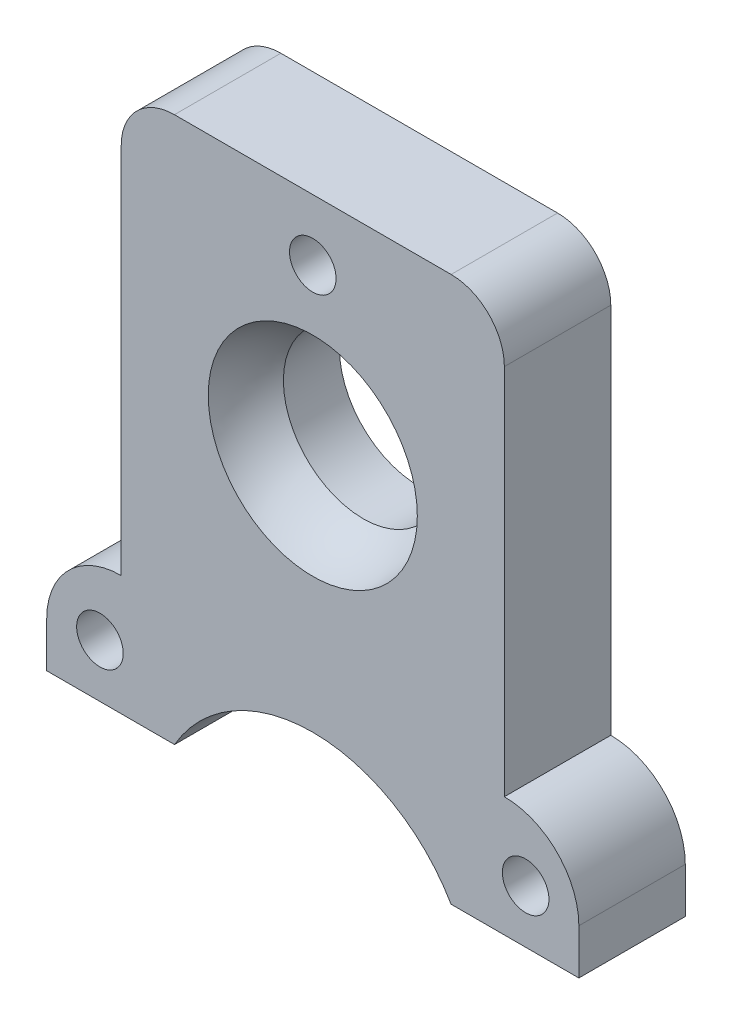
ISO-10303-21;
HEADER;
FILE_DESCRIPTION(('STEP AP214'),'2;1');
FILE_NAME('part.step','',(''),(''),'','','');
FILE_SCHEMA(('AUTOMOTIVE_DESIGN { 1 0 10303 214 1 1 1 1 }'));
ENDSEC;
DATA;
#1=APPLICATION_CONTEXT('core data for automotive mechanical design processes');
#2=APPLICATION_PROTOCOL_DEFINITION('international standard','automotive_design',2000,#1);
#3=PRODUCT_CONTEXT('',#1,'mechanical');
#4=PRODUCT('Part','Part','',(#3));
#5=PRODUCT_RELATED_PRODUCT_CATEGORY('part','',(#4));
#6=PRODUCT_DEFINITION_FORMATION('','',#4);
#7=PRODUCT_DEFINITION_CONTEXT('part definition',#1,'design');
#8=PRODUCT_DEFINITION('design','',#6,#7);
#9=PRODUCT_DEFINITION_SHAPE('','',#8);
#10=(LENGTH_UNIT() NAMED_UNIT(*) SI_UNIT(.MILLI.,.METRE.));
#11=(NAMED_UNIT(*) PLANE_ANGLE_UNIT() SI_UNIT($,.RADIAN.));
#12=(NAMED_UNIT(*) SI_UNIT($,.STERADIAN.) SOLID_ANGLE_UNIT());
#13=UNCERTAINTY_MEASURE_WITH_UNIT(LENGTH_MEASURE(1.E-05),#10,'distance_accuracy_value','');
#14=(GEOMETRIC_REPRESENTATION_CONTEXT(3) GLOBAL_UNCERTAINTY_ASSIGNED_CONTEXT((#13)) GLOBAL_UNIT_ASSIGNED_CONTEXT((#10,
#11,#12)) REPRESENTATION_CONTEXT('',''));
#15=CARTESIAN_POINT('',(0.,0.,0.));
#16=DIRECTION('',(0.,0.,1.));
#17=DIRECTION('',(1.,0.,0.));
#18=AXIS2_PLACEMENT_3D('',#15,#16,#17);
#19=CARTESIAN_POINT('',(0.,-12.1285,0.));
#20=DIRECTION('',(0.,0.,1.));
#21=DIRECTION('',(1.,0.,0.));
#22=AXIS2_PLACEMENT_3D('',#19,#20,#21);
#23=PLANE('',#22);
#24=CARTESIAN_POINT('',(0.,21.5265,0.));
#25=DIRECTION('',(0.,0.,1.));
#26=DIRECTION('',(1.,0.,0.));
#27=AXIS2_PLACEMENT_3D('',#24,#25,#26);
#28=CIRCLE('',#27,1.3890625);
#29=CARTESIAN_POINT('',(1.3890625,21.5265,0.));
#30=VERTEX_POINT('',#29);
#31=EDGE_CURVE('E644',#30,#30,#28,.T.);
#32=ORIENTED_EDGE('',*,*,#31,.F.);
#33=EDGE_LOOP('',(#32));
#34=FACE_BOUND('',#33,.T.);
#35=CARTESIAN_POINT('',(-12.7,-4.191,0.));
#36=DIRECTION('',(0.,0.,1.));
#37=DIRECTION('',(1.,0.,0.));
#38=AXIS2_PLACEMENT_3D('',#35,#36,#37);
#39=CIRCLE('',#38,1.3890625);
#40=CARTESIAN_POINT('',(-11.3109375,-4.191,0.));
#41=VERTEX_POINT('',#40);
#42=EDGE_CURVE('E640',#41,#41,#39,.T.);
#43=ORIENTED_EDGE('',*,*,#42,.F.);
#44=EDGE_LOOP('',(#43));
#45=FACE_BOUND('',#44,.T.);
#46=CARTESIAN_POINT('',(12.7,-4.191,0.));
#47=DIRECTION('',(0.,0.,1.));
#48=DIRECTION('',(-1.,0.,0.));
#49=AXIS2_PLACEMENT_3D('',#46,#47,#48);
#50=CIRCLE('',#49,1.3890625);
#51=CARTESIAN_POINT('',(11.3109375,-4.191,0.));
#52=VERTEX_POINT('',#51);
#53=EDGE_CURVE('E636',#52,#52,#50,.T.);
#54=ORIENTED_EDGE('',*,*,#53,.F.);
#55=EDGE_LOOP('',(#54));
#56=FACE_BOUND('',#55,.T.);
#57=CARTESIAN_POINT('',(0.,-12.1285,0.));
#58=DIRECTION('',(0.,0.,-1.));
#59=DIRECTION('',(1.,0.,0.));
#60=AXIS2_PLACEMENT_3D('',#57,#58,#59);
#61=CIRCLE('',#60,9.525);
#62=CARTESIAN_POINT('',(-8.24889197104678,-7.36600000000001,0.));
#63=VERTEX_POINT('',#62);
#64=CARTESIAN_POINT('',(8.24889197104678,-7.36600000000001,0.));
#65=VERTEX_POINT('',#64);
#66=EDGE_CURVE('E450',#63,#65,#61,.T.);
#67=ORIENTED_EDGE('',*,*,#66,.T.);
#68=DIRECTION('',(1.,0.,0.));
#69=VECTOR('',#68,1.);
#70=CARTESIAN_POINT('',(8.24889197104678,-7.36600000000001,0.));
#71=LINE('',#70,#69);
#72=CARTESIAN_POINT('',(15.875,-7.36600000000001,0.));
#73=VERTEX_POINT('',#72);
#74=EDGE_CURVE('E459',#65,#73,#71,.T.);
#75=ORIENTED_EDGE('',*,*,#74,.T.);
#76=DIRECTION('',(0.,1.,0.));
#77=VECTOR('',#76,1.);
#78=CARTESIAN_POINT('',(15.875,-7.36600000000001,0.));
#79=LINE('',#78,#77);
#80=CARTESIAN_POINT('',(15.875,-4.66725,0.));
#81=VERTEX_POINT('',#80);
#82=EDGE_CURVE('E464',#73,#81,#79,.T.);
#83=ORIENTED_EDGE('',*,*,#82,.T.);
#84=CARTESIAN_POINT('',(11.43,-4.66725000000001,0.));
#85=DIRECTION('',(0.,0.,1.));
#86=DIRECTION('',(1.,0.,0.));
#87=AXIS2_PLACEMENT_3D('',#84,#85,#86);
#88=CIRCLE('',#87,4.445);
#89=CARTESIAN_POINT('',(11.43,-0.222250000000007,0.));
#90=VERTEX_POINT('',#89);
#91=EDGE_CURVE('E477',#81,#90,#88,.T.);
#92=ORIENTED_EDGE('',*,*,#91,.T.);
#93=DIRECTION('',(0.,1.,0.));
#94=VECTOR('',#93,1.);
#95=CARTESIAN_POINT('',(11.43,-0.222250000000007,0.));
#96=LINE('',#95,#94);
#97=CARTESIAN_POINT('',(11.43,22.00275,0.));
#98=VERTEX_POINT('',#97);
#99=EDGE_CURVE('E480',#90,#98,#96,.T.);
#100=ORIENTED_EDGE('',*,*,#99,.T.);
#101=CARTESIAN_POINT('',(8.255,22.00275,0.));
#102=DIRECTION('',(0.,0.,1.));
#103=DIRECTION('',(1.,0.,0.));
#104=AXIS2_PLACEMENT_3D('',#101,#102,#103);
#105=CIRCLE('',#104,3.175);
#106=CARTESIAN_POINT('',(8.255,25.17775,0.));
#107=VERTEX_POINT('',#106);
#108=EDGE_CURVE('E483',#98,#107,#105,.T.);
#109=ORIENTED_EDGE('',*,*,#108,.T.);
#110=DIRECTION('',(-1.,0.,0.));
#111=VECTOR('',#110,1.);
#112=CARTESIAN_POINT('',(8.255,25.17775,0.));
#113=LINE('',#112,#111);
#114=CARTESIAN_POINT('',(-8.255,25.17775,0.));
#115=VERTEX_POINT('',#114);
#116=EDGE_CURVE('E486',#107,#115,#113,.T.);
#117=ORIENTED_EDGE('',*,*,#116,.T.);
#118=CARTESIAN_POINT('',(-8.255,22.00275,0.));
#119=DIRECTION('',(0.,0.,1.));
#120=DIRECTION('',(-1.,0.,0.));
#121=AXIS2_PLACEMENT_3D('',#118,#119,#120);
#122=CIRCLE('',#121,3.175);
#123=CARTESIAN_POINT('',(-11.43,22.00275,0.));
#124=VERTEX_POINT('',#123);
#125=EDGE_CURVE('E489',#115,#124,#122,.T.);
#126=ORIENTED_EDGE('',*,*,#125,.T.);
#127=DIRECTION('',(0.,-1.,0.));
#128=VECTOR('',#127,1.);
#129=CARTESIAN_POINT('',(-11.43,-0.222250000000007,0.));
#130=LINE('',#129,#128);
#131=CARTESIAN_POINT('',(-11.43,-0.222250000000008,0.));
#132=VERTEX_POINT('',#131);
#133=EDGE_CURVE('E492',#124,#132,#130,.T.);
#134=ORIENTED_EDGE('',*,*,#133,.T.);
#135=CARTESIAN_POINT('',(-11.43,-4.66725000000001,0.));
#136=DIRECTION('',(0.,0.,1.));
#137=DIRECTION('',(-1.,0.,0.));
#138=AXIS2_PLACEMENT_3D('',#135,#136,#137);
#139=CIRCLE('',#138,4.445);
#140=CARTESIAN_POINT('',(-15.875,-4.66725,0.));
#141=VERTEX_POINT('',#140);
#142=EDGE_CURVE('E495',#132,#141,#139,.T.);
#143=ORIENTED_EDGE('',*,*,#142,.T.);
#144=DIRECTION('',(0.,-1.,0.));
#145=VECTOR('',#144,1.);
#146=CARTESIAN_POINT('',(-15.875,-7.36600000000001,0.));
#147=LINE('',#146,#145);
#148=CARTESIAN_POINT('',(-15.875,-7.36600000000001,0.));
#149=VERTEX_POINT('',#148);
#150=EDGE_CURVE('E498',#141,#149,#147,.T.);
#151=ORIENTED_EDGE('',*,*,#150,.T.);
#152=DIRECTION('',(1.,0.,0.));
#153=VECTOR('',#152,1.);
#154=CARTESIAN_POINT('',(-8.24889197104678,-7.36600000000001,0.));
#155=LINE('',#154,#153);
#156=EDGE_CURVE('E468',#149,#63,#155,.T.);
#157=ORIENTED_EDGE('',*,*,#156,.T.);
#158=EDGE_LOOP('',(#67,#75,#83,#92,#100,#109,#117,#126,#134,#143,#151,#157));
#159=FACE_BOUND('',#158,.T.);
#160=CARTESIAN_POINT('',(0.,11.684,0.));
#161=DIRECTION('',(0.,0.,1.));
#162=DIRECTION('',(1.,0.,0.));
#163=AXIS2_PLACEMENT_3D('',#160,#161,#162);
#164=CIRCLE('',#163,6.23738022805849);
#165=CARTESIAN_POINT('',(6.23738022805849,11.684,0.));
#166=VERTEX_POINT('',#165);
#167=EDGE_CURVE('E364',#166,#166,#164,.F.);
#168=ORIENTED_EDGE('',*,*,#167,.T.);
#169=EDGE_LOOP('',(#168));
#170=FACE_BOUND('',#169,.T.);
#171=ADVANCED_FACE('F360',(#34,#45,#56,#159,#170),#23,.T.);
#172=CARTESIAN_POINT('',(0.,-12.1285,-6.35));
#173=DIRECTION('',(0.,0.,1.));
#174=DIRECTION('',(1.,0.,0.));
#175=AXIS2_PLACEMENT_3D('',#172,#173,#174);
#176=CYLINDRICAL_SURFACE('',#175,9.525);
#177=ORIENTED_EDGE('',*,*,#66,.F.);
#178=DIRECTION('',(0.,0.,1.));
#179=VECTOR('',#178,1.);
#180=CARTESIAN_POINT('',(-8.24889197104678,-7.36600000000001,-6.35));
#181=LINE('',#180,#179);
#182=CARTESIAN_POINT('',(-8.24889197104678,-7.36600000000001,-6.35));
#183=VERTEX_POINT('',#182);
#184=EDGE_CURVE('E11',#183,#63,#181,.T.);
#185=ORIENTED_EDGE('',*,*,#184,.F.);
#186=CARTESIAN_POINT('',(0.,-12.1285,-6.35));
#187=DIRECTION('',(0.,0.,-1.));
#188=DIRECTION('',(1.,0.,0.));
#189=AXIS2_PLACEMENT_3D('',#186,#187,#188);
#190=CIRCLE('',#189,9.525);
#191=CARTESIAN_POINT('',(8.24889197104678,-7.36600000000001,-6.35));
#192=VERTEX_POINT('',#191);
#193=EDGE_CURVE('E452',#183,#192,#190,.T.);
#194=ORIENTED_EDGE('',*,*,#193,.T.);
#195=DIRECTION('',(0.,0.,1.));
#196=VECTOR('',#195,1.);
#197=CARTESIAN_POINT('',(8.24889197104678,-7.36600000000001,-6.35));
#198=LINE('',#197,#196);
#199=EDGE_CURVE('E447',#192,#65,#198,.T.);
#200=ORIENTED_EDGE('',*,*,#199,.T.);
#201=EDGE_LOOP('',(#177,#185,#194,#200));
#202=FACE_BOUND('',#201,.T.);
#203=ADVANCED_FACE('F362',(#202),#176,.F.);
#204=CARTESIAN_POINT('',(-8.24889197104678,-7.36600000000001,-6.35));
#205=DIRECTION('',(0.,-1.,0.));
#206=DIRECTION('',(0.,0.,-1.));
#207=AXIS2_PLACEMENT_3D('',#204,#205,#206);
#208=PLANE('',#207);
#209=ORIENTED_EDGE('',*,*,#156,.F.);
#210=DIRECTION('',(0.,0.,1.));
#211=VECTOR('',#210,1.);
#212=CARTESIAN_POINT('',(-15.875,-7.36600000000001,-6.35));
#213=LINE('',#212,#211);
#214=CARTESIAN_POINT('',(-15.875,-7.36600000000001,-6.35));
#215=VERTEX_POINT('',#214);
#216=EDGE_CURVE('E369',#215,#149,#213,.T.);
#217=ORIENTED_EDGE('',*,*,#216,.F.);
#218=DIRECTION('',(1.,0.,0.));
#219=VECTOR('',#218,1.);
#220=CARTESIAN_POINT('',(-8.24889197104678,-7.36600000000001,-6.35));
#221=LINE('',#220,#219);
#222=EDGE_CURVE('E457',#215,#183,#221,.T.);
#223=ORIENTED_EDGE('',*,*,#222,.T.);
#224=ORIENTED_EDGE('',*,*,#184,.T.);
#225=EDGE_LOOP('',(#209,#217,#223,#224));
#226=FACE_BOUND('',#225,.T.);
#227=ADVANCED_FACE('F581',(#226),#208,.T.);
#228=CARTESIAN_POINT('',(-15.875,-7.36600000000001,-6.35));
#229=DIRECTION('',(-1.,0.,0.));
#230=DIRECTION('',(0.,0.,1.));
#231=AXIS2_PLACEMENT_3D('',#228,#229,#230);
#232=PLANE('',#231);
#233=ORIENTED_EDGE('',*,*,#150,.F.);
#234=DIRECTION('',(0.,0.,1.));
#235=VECTOR('',#234,1.);
#236=CARTESIAN_POINT('',(-15.875,-4.66725,-6.35));
#237=LINE('',#236,#235);
#238=CARTESIAN_POINT('',(-15.875,-4.66725,-6.35));
#239=VERTEX_POINT('',#238);
#240=EDGE_CURVE('E532',#239,#141,#237,.T.);
#241=ORIENTED_EDGE('',*,*,#240,.F.);
#242=DIRECTION('',(0.,-1.,0.));
#243=VECTOR('',#242,1.);
#244=CARTESIAN_POINT('',(-15.875,-7.36600000000001,-6.35));
#245=LINE('',#244,#243);
#246=EDGE_CURVE('E528',#239,#215,#245,.T.);
#247=ORIENTED_EDGE('',*,*,#246,.T.);
#248=ORIENTED_EDGE('',*,*,#216,.T.);
#249=EDGE_LOOP('',(#233,#241,#247,#248));
#250=FACE_BOUND('',#249,.T.);
#251=ADVANCED_FACE('F586',(#250),#232,.T.);
#252=CARTESIAN_POINT('',(-11.43,-4.66725000000001,-6.35));
#253=DIRECTION('',(0.,0.,1.));
#254=DIRECTION('',(1.,0.,0.));
#255=AXIS2_PLACEMENT_3D('',#252,#253,#254);
#256=CYLINDRICAL_SURFACE('',#255,4.445);
#257=ORIENTED_EDGE('',*,*,#142,.F.);
#258=DIRECTION('',(0.,0.,1.));
#259=VECTOR('',#258,1.);
#260=CARTESIAN_POINT('',(-11.43,-0.222250000000008,-6.35));
#261=LINE('',#260,#259);
#262=CARTESIAN_POINT('',(-11.43,-0.222250000000008,-6.35));
#263=VERTEX_POINT('',#262);
#264=EDGE_CURVE('E534',#263,#132,#261,.T.);
#265=ORIENTED_EDGE('',*,*,#264,.F.);
#266=CARTESIAN_POINT('',(-11.43,-4.66725000000001,-6.35));
#267=DIRECTION('',(0.,0.,1.));
#268=DIRECTION('',(-1.,0.,0.));
#269=AXIS2_PLACEMENT_3D('',#266,#267,#268);
#270=CIRCLE('',#269,4.445);
#271=EDGE_CURVE('E525',#263,#239,#270,.T.);
#272=ORIENTED_EDGE('',*,*,#271,.T.);
#273=ORIENTED_EDGE('',*,*,#240,.T.);
#274=EDGE_LOOP('',(#257,#265,#272,#273));
#275=FACE_BOUND('',#274,.T.);
#276=ADVANCED_FACE('F578',(#275),#256,.T.);
#277=CARTESIAN_POINT('',(-11.43,-0.222250000000007,-6.35));
#278=DIRECTION('',(-1.,0.,0.));
#279=DIRECTION('',(0.,-1.,0.));
#280=AXIS2_PLACEMENT_3D('',#277,#278,#279);
#281=PLANE('',#280);
#282=ORIENTED_EDGE('',*,*,#133,.F.);
#283=DIRECTION('',(0.,0.,1.));
#284=VECTOR('',#283,1.);
#285=CARTESIAN_POINT('',(-11.43,22.00275,-6.35));
#286=LINE('',#285,#284);
#287=CARTESIAN_POINT('',(-11.43,22.00275,-6.35));
#288=VERTEX_POINT('',#287);
#289=EDGE_CURVE('E536',#288,#124,#286,.T.);
#290=ORIENTED_EDGE('',*,*,#289,.F.);
#291=DIRECTION('',(0.,-1.,0.));
#292=VECTOR('',#291,1.);
#293=CARTESIAN_POINT('',(-11.43,-0.222250000000007,-6.35));
#294=LINE('',#293,#292);
#295=EDGE_CURVE('E522',#288,#263,#294,.T.);
#296=ORIENTED_EDGE('',*,*,#295,.T.);
#297=ORIENTED_EDGE('',*,*,#264,.T.);
#298=EDGE_LOOP('',(#282,#290,#296,#297));
#299=FACE_BOUND('',#298,.T.);
#300=ADVANCED_FACE('F574',(#299),#281,.T.);
#301=CARTESIAN_POINT('',(-8.255,22.00275,-6.35));
#302=DIRECTION('',(0.,0.,1.));
#303=DIRECTION('',(1.,0.,0.));
#304=AXIS2_PLACEMENT_3D('',#301,#302,#303);
#305=CYLINDRICAL_SURFACE('',#304,3.175);
#306=ORIENTED_EDGE('',*,*,#125,.F.);
#307=DIRECTION('',(0.,0.,1.));
#308=VECTOR('',#307,1.);
#309=CARTESIAN_POINT('',(-8.255,25.17775,-6.35));
#310=LINE('',#309,#308);
#311=CARTESIAN_POINT('',(-8.255,25.17775,-6.35));
#312=VERTEX_POINT('',#311);
#313=EDGE_CURVE('E538',#312,#115,#310,.T.);
#314=ORIENTED_EDGE('',*,*,#313,.F.);
#315=CARTESIAN_POINT('',(-8.255,22.00275,-6.35));
#316=DIRECTION('',(0.,0.,1.));
#317=DIRECTION('',(-1.,0.,0.));
#318=AXIS2_PLACEMENT_3D('',#315,#316,#317);
#319=CIRCLE('',#318,3.175);
#320=EDGE_CURVE('E519',#312,#288,#319,.T.);
#321=ORIENTED_EDGE('',*,*,#320,.T.);
#322=ORIENTED_EDGE('',*,*,#289,.T.);
#323=EDGE_LOOP('',(#306,#314,#321,#322));
#324=FACE_BOUND('',#323,.T.);
#325=ADVANCED_FACE('F570',(#324),#305,.T.);
#326=CARTESIAN_POINT('',(8.255,25.17775,-6.35));
#327=DIRECTION('',(0.,1.,0.));
#328=DIRECTION('',(0.,0.,1.));
#329=AXIS2_PLACEMENT_3D('',#326,#327,#328);
#330=PLANE('',#329);
#331=ORIENTED_EDGE('',*,*,#116,.F.);
#332=DIRECTION('',(0.,0.,1.));
#333=VECTOR('',#332,1.);
#334=CARTESIAN_POINT('',(8.255,25.17775,-6.35));
#335=LINE('',#334,#333);
#336=CARTESIAN_POINT('',(8.255,25.17775,-6.35));
#337=VERTEX_POINT('',#336);
#338=EDGE_CURVE('E540',#337,#107,#335,.T.);
#339=ORIENTED_EDGE('',*,*,#338,.F.);
#340=DIRECTION('',(-1.,0.,0.));
#341=VECTOR('',#340,1.);
#342=CARTESIAN_POINT('',(8.255,25.17775,-6.35));
#343=LINE('',#342,#341);
#344=EDGE_CURVE('E516',#337,#312,#343,.T.);
#345=ORIENTED_EDGE('',*,*,#344,.T.);
#346=ORIENTED_EDGE('',*,*,#313,.T.);
#347=EDGE_LOOP('',(#331,#339,#345,#346));
#348=FACE_BOUND('',#347,.T.);
#349=ADVANCED_FACE('F566',(#348),#330,.T.);
#350=CARTESIAN_POINT('',(8.255,22.00275,-6.35));
#351=DIRECTION('',(0.,0.,1.));
#352=DIRECTION('',(1.,0.,0.));
#353=AXIS2_PLACEMENT_3D('',#350,#351,#352);
#354=CYLINDRICAL_SURFACE('',#353,3.175);
#355=ORIENTED_EDGE('',*,*,#108,.F.);
#356=DIRECTION('',(0.,0.,1.));
#357=VECTOR('',#356,1.);
#358=CARTESIAN_POINT('',(11.43,22.00275,-6.35));
#359=LINE('',#358,#357);
#360=CARTESIAN_POINT('',(11.43,22.00275,-6.35));
#361=VERTEX_POINT('',#360);
#362=EDGE_CURVE('E542',#361,#98,#359,.T.);
#363=ORIENTED_EDGE('',*,*,#362,.F.);
#364=CARTESIAN_POINT('',(8.255,22.00275,-6.35));
#365=DIRECTION('',(0.,0.,1.));
#366=DIRECTION('',(1.,0.,0.));
#367=AXIS2_PLACEMENT_3D('',#364,#365,#366);
#368=CIRCLE('',#367,3.175);
#369=EDGE_CURVE('E513',#361,#337,#368,.T.);
#370=ORIENTED_EDGE('',*,*,#369,.T.);
#371=ORIENTED_EDGE('',*,*,#338,.T.);
#372=EDGE_LOOP('',(#355,#363,#370,#371));
#373=FACE_BOUND('',#372,.T.);
#374=ADVANCED_FACE('F562',(#373),#354,.T.);
#375=CARTESIAN_POINT('',(11.43,-0.222250000000007,-6.35));
#376=DIRECTION('',(1.,0.,0.));
#377=DIRECTION('',(0.,1.,0.));
#378=AXIS2_PLACEMENT_3D('',#375,#376,#377);
#379=PLANE('',#378);
#380=ORIENTED_EDGE('',*,*,#99,.F.);
#381=DIRECTION('',(0.,0.,1.));
#382=VECTOR('',#381,1.);
#383=CARTESIAN_POINT('',(11.43,-0.222250000000007,-6.35));
#384=LINE('',#383,#382);
#385=CARTESIAN_POINT('',(11.43,-0.222250000000007,-6.35));
#386=VERTEX_POINT('',#385);
#387=EDGE_CURVE('E544',#386,#90,#384,.T.);
#388=ORIENTED_EDGE('',*,*,#387,.F.);
#389=DIRECTION('',(0.,1.,0.));
#390=VECTOR('',#389,1.);
#391=CARTESIAN_POINT('',(11.43,-0.222250000000007,-6.35));
#392=LINE('',#391,#390);
#393=EDGE_CURVE('E510',#386,#361,#392,.T.);
#394=ORIENTED_EDGE('',*,*,#393,.T.);
#395=ORIENTED_EDGE('',*,*,#362,.T.);
#396=EDGE_LOOP('',(#380,#388,#394,#395));
#397=FACE_BOUND('',#396,.T.);
#398=ADVANCED_FACE('F558',(#397),#379,.T.);
#399=CARTESIAN_POINT('',(11.43,-4.66725000000001,-6.35));
#400=DIRECTION('',(0.,0.,1.));
#401=DIRECTION('',(1.,0.,0.));
#402=AXIS2_PLACEMENT_3D('',#399,#400,#401);
#403=CYLINDRICAL_SURFACE('',#402,4.445);
#404=ORIENTED_EDGE('',*,*,#91,.F.);
#405=DIRECTION('',(0.,0.,1.));
#406=VECTOR('',#405,1.);
#407=CARTESIAN_POINT('',(15.875,-4.66725,-6.35));
#408=LINE('',#407,#406);
#409=CARTESIAN_POINT('',(15.875,-4.66725,-6.35));
#410=VERTEX_POINT('',#409);
#411=EDGE_CURVE('E546',#410,#81,#408,.T.);
#412=ORIENTED_EDGE('',*,*,#411,.F.);
#413=CARTESIAN_POINT('',(11.43,-4.66725000000001,-6.35));
#414=DIRECTION('',(0.,0.,1.));
#415=DIRECTION('',(1.,0.,0.));
#416=AXIS2_PLACEMENT_3D('',#413,#414,#415);
#417=CIRCLE('',#416,4.445);
#418=EDGE_CURVE('E507',#410,#386,#417,.T.);
#419=ORIENTED_EDGE('',*,*,#418,.T.);
#420=ORIENTED_EDGE('',*,*,#387,.T.);
#421=EDGE_LOOP('',(#404,#412,#419,#420));
#422=FACE_BOUND('',#421,.T.);
#423=ADVANCED_FACE('F554',(#422),#403,.T.);
#424=CARTESIAN_POINT('',(15.875,-7.36600000000001,-6.35));
#425=DIRECTION('',(1.,0.,0.));
#426=DIRECTION('',(0.,0.,-1.));
#427=AXIS2_PLACEMENT_3D('',#424,#425,#426);
#428=PLANE('',#427);
#429=ORIENTED_EDGE('',*,*,#82,.F.);
#430=DIRECTION('',(0.,0.,1.));
#431=VECTOR('',#430,1.);
#432=CARTESIAN_POINT('',(15.875,-7.36600000000001,-6.35));
#433=LINE('',#432,#431);
#434=CARTESIAN_POINT('',(15.875,-7.36600000000001,-6.35));
#435=VERTEX_POINT('',#434);
#436=EDGE_CURVE('E456',#435,#73,#433,.T.);
#437=ORIENTED_EDGE('',*,*,#436,.F.);
#438=DIRECTION('',(0.,1.,0.));
#439=VECTOR('',#438,1.);
#440=CARTESIAN_POINT('',(15.875,-7.36600000000001,-6.35));
#441=LINE('',#440,#439);
#442=EDGE_CURVE('E504',#435,#410,#441,.T.);
#443=ORIENTED_EDGE('',*,*,#442,.T.);
#444=ORIENTED_EDGE('',*,*,#411,.T.);
#445=EDGE_LOOP('',(#429,#437,#443,#444));
#446=FACE_BOUND('',#445,.T.);
#447=ADVANCED_FACE('F550',(#446),#428,.T.);
#448=CARTESIAN_POINT('',(8.24889197104678,-7.36600000000001,-6.35));
#449=DIRECTION('',(0.,-1.,0.));
#450=DIRECTION('',(0.,0.,-1.));
#451=AXIS2_PLACEMENT_3D('',#448,#449,#450);
#452=PLANE('',#451);
#453=ORIENTED_EDGE('',*,*,#74,.F.);
#454=ORIENTED_EDGE('',*,*,#199,.F.);
#455=DIRECTION('',(1.,0.,0.));
#456=VECTOR('',#455,1.);
#457=CARTESIAN_POINT('',(8.24889197104678,-7.36600000000001,-6.35));
#458=LINE('',#457,#456);
#459=EDGE_CURVE('E502',#192,#435,#458,.T.);
#460=ORIENTED_EDGE('',*,*,#459,.T.);
#461=ORIENTED_EDGE('',*,*,#436,.T.);
#462=EDGE_LOOP('',(#453,#454,#460,#461));
#463=FACE_BOUND('',#462,.T.);
#464=ADVANCED_FACE('F460',(#463),#452,.T.);
#465=CARTESIAN_POINT('',(0.,-12.1285,-6.35));
#466=DIRECTION('',(0.,0.,1.));
#467=DIRECTION('',(1.,0.,0.));
#468=AXIS2_PLACEMENT_3D('',#465,#466,#467);
#469=PLANE('',#468);
#470=CARTESIAN_POINT('',(0.,21.5265,-6.35));
#471=DIRECTION('',(0.,0.,1.));
#472=DIRECTION('',(1.,0.,0.));
#473=AXIS2_PLACEMENT_3D('',#470,#471,#472);
#474=CIRCLE('',#473,1.3890625);
#475=CARTESIAN_POINT('',(1.3890625,21.5265,-6.35));
#476=VERTEX_POINT('',#475);
#477=EDGE_CURVE('E621',#476,#476,#474,.F.);
#478=ORIENTED_EDGE('',*,*,#477,.F.);
#479=EDGE_LOOP('',(#478));
#480=FACE_BOUND('',#479,.T.);
#481=CARTESIAN_POINT('',(-12.7,-4.191,-6.35));
#482=DIRECTION('',(0.,0.,1.));
#483=DIRECTION('',(1.,0.,0.));
#484=AXIS2_PLACEMENT_3D('',#481,#482,#483);
#485=CIRCLE('',#484,1.3890625);
#486=CARTESIAN_POINT('',(-11.3109375,-4.191,-6.35));
#487=VERTEX_POINT('',#486);
#488=EDGE_CURVE('E625',#487,#487,#485,.F.);
#489=ORIENTED_EDGE('',*,*,#488,.F.);
#490=EDGE_LOOP('',(#489));
#491=FACE_BOUND('',#490,.T.);
#492=CARTESIAN_POINT('',(12.7,-4.191,-6.35));
#493=DIRECTION('',(0.,0.,1.));
#494=DIRECTION('',(1.,0.,0.));
#495=AXIS2_PLACEMENT_3D('',#492,#493,#494);
#496=CIRCLE('',#495,1.3890625);
#497=CARTESIAN_POINT('',(14.0890625,-4.191,-6.35));
#498=VERTEX_POINT('',#497);
#499=EDGE_CURVE('E629',#498,#498,#496,.F.);
#500=ORIENTED_EDGE('',*,*,#499,.F.);
#501=EDGE_LOOP('',(#500));
#502=FACE_BOUND('',#501,.T.);
#503=CARTESIAN_POINT('',(0.,11.684,-6.35));
#504=DIRECTION('',(0.,0.,-1.));
#505=DIRECTION('',(-1.,0.,0.));
#506=AXIS2_PLACEMENT_3D('',#503,#504,#505);
#507=CIRCLE('',#506,4.7625);
#508=CARTESIAN_POINT('',(-4.7625,11.684,-6.35));
#509=VERTEX_POINT('',#508);
#510=EDGE_CURVE('E471',#509,#509,#507,.T.);
#511=ORIENTED_EDGE('',*,*,#510,.F.);
#512=EDGE_LOOP('',(#511));
#513=FACE_BOUND('',#512,.T.);
#514=ORIENTED_EDGE('',*,*,#193,.F.);
#515=ORIENTED_EDGE('',*,*,#222,.F.);
#516=ORIENTED_EDGE('',*,*,#246,.F.);
#517=ORIENTED_EDGE('',*,*,#271,.F.);
#518=ORIENTED_EDGE('',*,*,#295,.F.);
#519=ORIENTED_EDGE('',*,*,#320,.F.);
#520=ORIENTED_EDGE('',*,*,#344,.F.);
#521=ORIENTED_EDGE('',*,*,#369,.F.);
#522=ORIENTED_EDGE('',*,*,#393,.F.);
#523=ORIENTED_EDGE('',*,*,#418,.F.);
#524=ORIENTED_EDGE('',*,*,#442,.F.);
#525=ORIENTED_EDGE('',*,*,#459,.F.);
#526=EDGE_LOOP('',(#514,#515,#516,#517,#518,#519,#520,#521,#522,#523,#524,#525));
#527=FACE_BOUND('',#526,.T.);
#528=ADVANCED_FACE('F585',(#480,#491,#502,#513,#527),#469,.F.);
#529=CARTESIAN_POINT('',(0.,11.684,1.190625));
#530=DIRECTION('',(0.,1.,0.));
#531=DIRECTION('',(0.,0.,-1.));
#532=AXIS2_PLACEMENT_3D('',#529,#530,#531);
#533=SPHERICAL_SURFACE('',#532,6.35);
#534=CARTESIAN_POINT('',(0.,11.684,1.190625));
#535=DIRECTION('',(0.,0.,1.));
#536=DIRECTION('',(1.,0.,0.));
#537=AXIS2_PLACEMENT_3D('',#534,#535,#536);
#538=SPHERICAL_SURFACE('',#537,6.35);
#539=CARTESIAN_POINT('',(0.,11.684,-3.00950520631504));
#540=DIRECTION('',(0.,0.,1.));
#541=DIRECTION('',(1.,0.,0.));
#542=AXIS2_PLACEMENT_3D('',#539,#540,#541);
#543=CIRCLE('',#542,4.7625);
#544=CARTESIAN_POINT('',(4.7625,11.684,-3.00950520631504));
#545=VERTEX_POINT('',#544);
#546=EDGE_CURVE('E473',#545,#545,#543,.F.);
#547=ORIENTED_EDGE('',*,*,#546,.T.);
#548=EDGE_LOOP('',(#547));
#549=FACE_BOUND('',#548,.T.);
#550=ORIENTED_EDGE('',*,*,#167,.F.);
#551=EDGE_LOOP('',(#550));
#552=FACE_BOUND('',#551,.T.);
#553=ADVANCED_FACE('F608',(#549,#552),#538,.F.);
#554=CARTESIAN_POINT('',(0.,11.684,0.00100000000000013));
#555=DIRECTION('',(0.,0.,-1.));
#556=DIRECTION('',(-1.,0.,0.));
#557=AXIS2_PLACEMENT_3D('',#554,#555,#556);
#558=CYLINDRICAL_SURFACE('',#557,4.7625);
#559=ORIENTED_EDGE('',*,*,#546,.F.);
#560=EDGE_LOOP('',(#559));
#561=FACE_BOUND('',#560,.T.);
#562=ORIENTED_EDGE('',*,*,#510,.T.);
#563=EDGE_LOOP('',(#562));
#564=FACE_BOUND('',#563,.T.);
#565=ADVANCED_FACE('F615',(#561,#564),#558,.F.);
#566=CARTESIAN_POINT('',(12.7,-4.191,-6.351));
#567=DIRECTION('',(0.,0.,1.));
#568=DIRECTION('',(1.,0.,0.));
#569=AXIS2_PLACEMENT_3D('',#566,#567,#568);
#570=CYLINDRICAL_SURFACE('',#569,1.3890625);
#571=ORIENTED_EDGE('',*,*,#53,.T.);
#572=EDGE_LOOP('',(#571));
#573=FACE_BOUND('',#572,.T.);
#574=ORIENTED_EDGE('',*,*,#499,.T.);
#575=EDGE_LOOP('',(#574));
#576=FACE_BOUND('',#575,.T.);
#577=ADVANCED_FACE('F655',(#573,#576),#570,.F.);
#578=CARTESIAN_POINT('',(-12.7,-4.191,-6.351));
#579=DIRECTION('',(0.,0.,1.));
#580=DIRECTION('',(1.,0.,0.));
#581=AXIS2_PLACEMENT_3D('',#578,#579,#580);
#582=CYLINDRICAL_SURFACE('',#581,1.3890625);
#583=ORIENTED_EDGE('',*,*,#42,.T.);
#584=EDGE_LOOP('',(#583));
#585=FACE_BOUND('',#584,.T.);
#586=ORIENTED_EDGE('',*,*,#488,.T.);
#587=EDGE_LOOP('',(#586));
#588=FACE_BOUND('',#587,.T.);
#589=ADVANCED_FACE('F650',(#585,#588),#582,.F.);
#590=CARTESIAN_POINT('',(0.,21.5265,-6.351));
#591=DIRECTION('',(0.,0.,1.));
#592=DIRECTION('',(1.,0.,0.));
#593=AXIS2_PLACEMENT_3D('',#590,#591,#592);
#594=CYLINDRICAL_SURFACE('',#593,1.3890625);
#595=ORIENTED_EDGE('',*,*,#31,.T.);
#596=EDGE_LOOP('',(#595));
#597=FACE_BOUND('',#596,.T.);
#598=ORIENTED_EDGE('',*,*,#477,.T.);
#599=EDGE_LOOP('',(#598));
#600=FACE_BOUND('',#599,.T.);
#601=ADVANCED_FACE('F647',(#597,#600),#594,.F.);
#602=CLOSED_SHELL('',(#171,#203,#227,#251,#276,#300,#325,#349,#374,#398,#423,#447,#464,#528,
#553,#565,#577,#589,#601));
#603=MANIFOLD_SOLID_BREP('B2',#602);
#604=ADVANCED_BREP_SHAPE_REPRESENTATION('',(#18,#603),#14);
#605=SHAPE_DEFINITION_REPRESENTATION(#9,#604);
ENDSEC;
END-ISO-10303-21;
